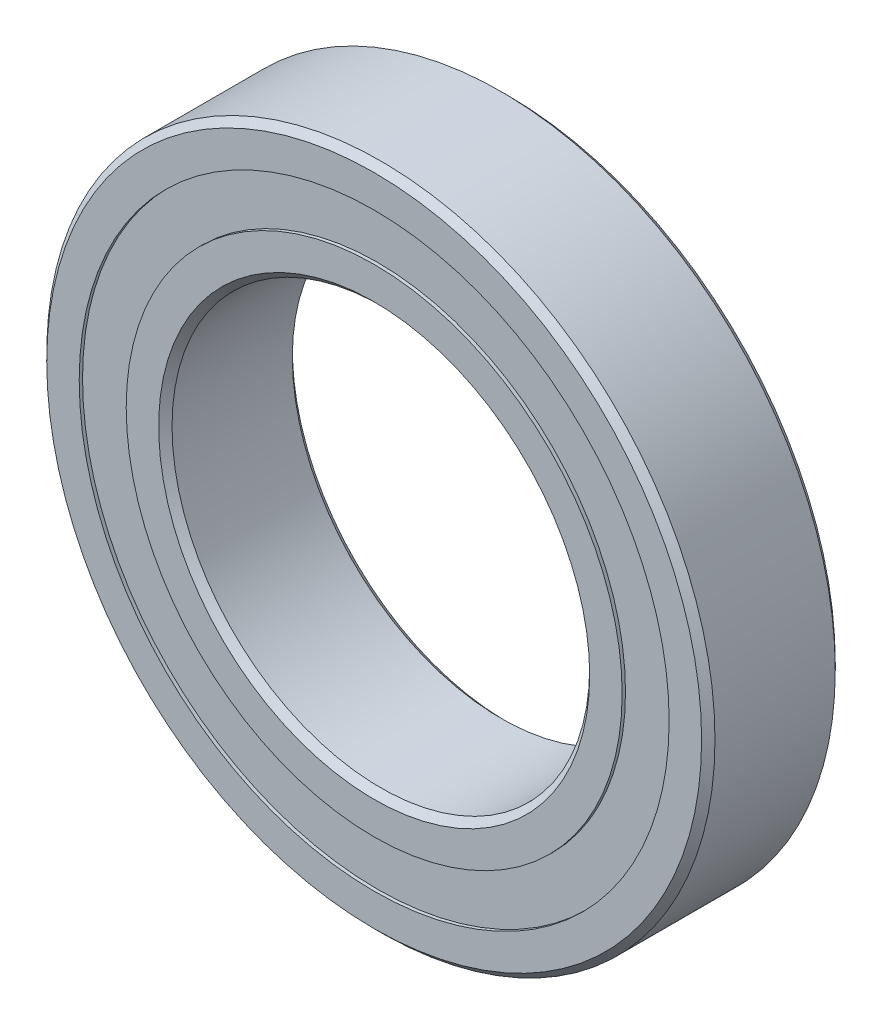
ISO-10303-21;
HEADER;
FILE_DESCRIPTION(('STEP AP214'),'2;1');
FILE_NAME('part.step','',(''),(''),'','','');
FILE_SCHEMA(('AUTOMOTIVE_DESIGN { 1 0 10303 214 1 1 1 1 }'));
ENDSEC;
DATA;
#1=APPLICATION_CONTEXT('core data for automotive mechanical design processes');
#2=APPLICATION_PROTOCOL_DEFINITION('international standard','automotive_design',2000,#1);
#3=PRODUCT_CONTEXT('',#1,'mechanical');
#4=PRODUCT('Part','Part','',(#3));
#5=PRODUCT_RELATED_PRODUCT_CATEGORY('part','',(#4));
#6=PRODUCT_DEFINITION_FORMATION('','',#4);
#7=PRODUCT_DEFINITION_CONTEXT('part definition',#1,'design');
#8=PRODUCT_DEFINITION('design','',#6,#7);
#9=PRODUCT_DEFINITION_SHAPE('','',#8);
#10=(LENGTH_UNIT() NAMED_UNIT(*) SI_UNIT(.MILLI.,.METRE.));
#11=(NAMED_UNIT(*) PLANE_ANGLE_UNIT() SI_UNIT($,.RADIAN.));
#12=(NAMED_UNIT(*) SI_UNIT($,.STERADIAN.) SOLID_ANGLE_UNIT());
#13=UNCERTAINTY_MEASURE_WITH_UNIT(LENGTH_MEASURE(1.E-05),#10,'distance_accuracy_value','');
#14=(GEOMETRIC_REPRESENTATION_CONTEXT(3) GLOBAL_UNCERTAINTY_ASSIGNED_CONTEXT((#13)) GLOBAL_UNIT_ASSIGNED_CONTEXT((#10,
#11,#12)) REPRESENTATION_CONTEXT('',''));
#15=CARTESIAN_POINT('',(0.,0.,0.));
#16=DIRECTION('',(0.,0.,1.));
#17=DIRECTION('',(1.,0.,0.));
#18=AXIS2_PLACEMENT_3D('',#15,#16,#17);
#19=CARTESIAN_POINT('',(0.,35.3131868131868,-7.60000000000001));
#20=DIRECTION('',(0.,0.,1.));
#21=DIRECTION('',(1.,0.,0.));
#22=AXIS2_PLACEMENT_3D('',#19,#20,#21);
#23=PLANE('',#22);
#24=CARTESIAN_POINT('',(0.,0.,-7.60000000000001));
#25=DIRECTION('',(0.,0.,1.));
#26=DIRECTION('',(1.,0.,0.));
#27=AXIS2_PLACEMENT_3D('',#24,#25,#26);
#28=CIRCLE('',#27,35.3131868131868);
#29=CARTESIAN_POINT('',(35.3131868131868,0.,-7.60000000000001));
#30=VERTEX_POINT('',#29);
#31=EDGE_CURVE('E55',#30,#30,#28,.T.);
#32=ORIENTED_EDGE('',*,*,#31,.F.);
#33=EDGE_LOOP('',(#32));
#34=FACE_BOUND('',#33,.T.);
#35=CARTESIAN_POINT('',(0.,0.,-7.60000000000001));
#36=DIRECTION('',(0.,0.,1.));
#37=DIRECTION('',(1.,0.,0.));
#38=AXIS2_PLACEMENT_3D('',#35,#36,#37);
#39=CIRCLE('',#38,29.6868131868132);
#40=CARTESIAN_POINT('',(29.6868131868132,0.,-7.60000000000001));
#41=VERTEX_POINT('',#40);
#42=EDGE_CURVE('E11',#41,#41,#39,.T.);
#43=ORIENTED_EDGE('',*,*,#42,.T.);
#44=EDGE_LOOP('',(#43));
#45=FACE_BOUND('',#44,.T.);
#46=ADVANCED_FACE('F41',(#34,#45),#23,.F.);
#47=CARTESIAN_POINT('',(0.,0.,8.));
#48=DIRECTION('',(0.,0.,1.));
#49=DIRECTION('',(1.,0.,0.));
#50=AXIS2_PLACEMENT_3D('',#47,#48,#49);
#51=CYLINDRICAL_SURFACE('',#50,29.6868131868132);
#52=ORIENTED_EDGE('',*,*,#42,.F.);
#53=EDGE_LOOP('',(#52));
#54=FACE_BOUND('',#53,.T.);
#55=CARTESIAN_POINT('',(0.,0.,-4.53387200464792));
#56=DIRECTION('',(0.,0.,1.));
#57=DIRECTION('',(1.,0.,0.));
#58=AXIS2_PLACEMENT_3D('',#55,#56,#57);
#59=CIRCLE('',#58,29.6868131868132);
#60=CARTESIAN_POINT('',(29.6868131868132,0.,-4.53387200464792));
#61=VERTEX_POINT('',#60);
#62=EDGE_CURVE('E47',#61,#61,#59,.T.);
#63=ORIENTED_EDGE('',*,*,#62,.T.);
#64=EDGE_LOOP('',(#63));
#65=FACE_BOUND('',#64,.T.);
#66=ADVANCED_FACE('F64',(#54,#65),#51,.F.);
#67=CARTESIAN_POINT('',(0.,35.3131868131868,-4.53387200464792));
#68=DIRECTION('',(0.,0.,-1.));
#69=DIRECTION('',(-1.,0.,0.));
#70=AXIS2_PLACEMENT_3D('',#67,#68,#69);
#71=PLANE('',#70);
#72=ORIENTED_EDGE('',*,*,#62,.F.);
#73=EDGE_LOOP('',(#72));
#74=FACE_BOUND('',#73,.T.);
#75=CARTESIAN_POINT('',(0.,0.,-4.53387200464792));
#76=DIRECTION('',(0.,0.,1.));
#77=DIRECTION('',(1.,0.,0.));
#78=AXIS2_PLACEMENT_3D('',#75,#76,#77);
#79=CIRCLE('',#78,35.3131868131868);
#80=CARTESIAN_POINT('',(35.3131868131868,0.,-4.53387200464792));
#81=VERTEX_POINT('',#80);
#82=EDGE_CURVE('E51',#81,#81,#79,.T.);
#83=ORIENTED_EDGE('',*,*,#82,.T.);
#84=EDGE_LOOP('',(#83));
#85=FACE_BOUND('',#84,.T.);
#86=ADVANCED_FACE('F68',(#74,#85),#71,.F.);
#87=CARTESIAN_POINT('',(0.,0.,8.));
#88=DIRECTION('',(0.,0.,1.));
#89=DIRECTION('',(1.,0.,0.));
#90=AXIS2_PLACEMENT_3D('',#87,#88,#89);
#91=CYLINDRICAL_SURFACE('',#90,35.3131868131868);
#92=ORIENTED_EDGE('',*,*,#82,.F.);
#93=EDGE_LOOP('',(#92));
#94=FACE_BOUND('',#93,.T.);
#95=ORIENTED_EDGE('',*,*,#31,.T.);
#96=EDGE_LOOP('',(#95));
#97=FACE_BOUND('',#96,.T.);
#98=ADVANCED_FACE('F61',(#94,#97),#91,.T.);
#99=CLOSED_SHELL('',(#46,#66,#86,#98));
#100=MANIFOLD_SOLID_BREP('B2',#99);
#101=CARTESIAN_POINT('',(0.,35.3131868131868,7.6));
#102=DIRECTION('',(0.,0.,-1.));
#103=DIRECTION('',(-1.,0.,0.));
#104=AXIS2_PLACEMENT_3D('',#101,#102,#103);
#105=PLANE('',#104);
#106=CARTESIAN_POINT('',(0.,0.,7.6));
#107=DIRECTION('',(0.,0.,1.));
#108=DIRECTION('',(1.,0.,0.));
#109=AXIS2_PLACEMENT_3D('',#106,#107,#108);
#110=CIRCLE('',#109,29.6868131868132);
#111=CARTESIAN_POINT('',(29.6868131868132,0.,7.6));
#112=VERTEX_POINT('',#111);
#113=EDGE_CURVE('E40',#112,#112,#110,.T.);
#114=ORIENTED_EDGE('',*,*,#113,.F.);
#115=EDGE_LOOP('',(#114));
#116=FACE_BOUND('',#115,.T.);
#117=CARTESIAN_POINT('',(0.,0.,7.6));
#118=DIRECTION('',(0.,0.,1.));
#119=DIRECTION('',(1.,0.,0.));
#120=AXIS2_PLACEMENT_3D('',#117,#118,#119);
#121=CIRCLE('',#120,35.3131868131868);
#122=CARTESIAN_POINT('',(35.3131868131868,0.,7.6));
#123=VERTEX_POINT('',#122);
#124=EDGE_CURVE('E122',#123,#123,#121,.T.);
#125=ORIENTED_EDGE('',*,*,#124,.T.);
#126=EDGE_LOOP('',(#125));
#127=FACE_BOUND('',#126,.T.);
#128=ADVANCED_FACE('F108',(#116,#127),#105,.F.);
#129=CARTESIAN_POINT('',(0.,0.,8.));
#130=DIRECTION('',(0.,0.,1.));
#131=DIRECTION('',(1.,0.,0.));
#132=AXIS2_PLACEMENT_3D('',#129,#130,#131);
#133=CYLINDRICAL_SURFACE('',#132,29.6868131868132);
#134=CARTESIAN_POINT('',(0.,0.,4.53387200464791));
#135=DIRECTION('',(0.,0.,1.));
#136=DIRECTION('',(1.,0.,0.));
#137=AXIS2_PLACEMENT_3D('',#134,#135,#136);
#138=CIRCLE('',#137,29.6868131868132);
#139=CARTESIAN_POINT('',(29.6868131868132,0.,4.53387200464791));
#140=VERTEX_POINT('',#139);
#141=EDGE_CURVE('E114',#140,#140,#138,.T.);
#142=ORIENTED_EDGE('',*,*,#141,.F.);
#143=EDGE_LOOP('',(#142));
#144=FACE_BOUND('',#143,.T.);
#145=ORIENTED_EDGE('',*,*,#113,.T.);
#146=EDGE_LOOP('',(#145));
#147=FACE_BOUND('',#146,.T.);
#148=ADVANCED_FACE('F137',(#144,#147),#133,.F.);
#149=CARTESIAN_POINT('',(0.,35.3131868131868,4.53387200464791));
#150=DIRECTION('',(0.,0.,1.));
#151=DIRECTION('',(1.,0.,0.));
#152=AXIS2_PLACEMENT_3D('',#149,#150,#151);
#153=PLANE('',#152);
#154=CARTESIAN_POINT('',(0.,0.,4.53387200464791));
#155=DIRECTION('',(0.,0.,1.));
#156=DIRECTION('',(1.,0.,0.));
#157=AXIS2_PLACEMENT_3D('',#154,#155,#156);
#158=CIRCLE('',#157,35.3131868131868);
#159=CARTESIAN_POINT('',(35.3131868131868,0.,4.53387200464791));
#160=VERTEX_POINT('',#159);
#161=EDGE_CURVE('E118',#160,#160,#158,.T.);
#162=ORIENTED_EDGE('',*,*,#161,.F.);
#163=EDGE_LOOP('',(#162));
#164=FACE_BOUND('',#163,.T.);
#165=ORIENTED_EDGE('',*,*,#141,.T.);
#166=EDGE_LOOP('',(#165));
#167=FACE_BOUND('',#166,.T.);
#168=ADVANCED_FACE('F132',(#164,#167),#153,.F.);
#169=CARTESIAN_POINT('',(0.,0.,8.));
#170=DIRECTION('',(0.,0.,1.));
#171=DIRECTION('',(1.,0.,0.));
#172=AXIS2_PLACEMENT_3D('',#169,#170,#171);
#173=CYLINDRICAL_SURFACE('',#172,35.3131868131868);
#174=ORIENTED_EDGE('',*,*,#124,.F.);
#175=EDGE_LOOP('',(#174));
#176=FACE_BOUND('',#175,.T.);
#177=ORIENTED_EDGE('',*,*,#161,.T.);
#178=EDGE_LOOP('',(#177));
#179=FACE_BOUND('',#178,.T.);
#180=ADVANCED_FACE('F129',(#176,#179),#173,.T.);
#181=CLOSED_SHELL('',(#128,#148,#168,#180));
#182=MANIFOLD_SOLID_BREP('B6',#181);
#183=CARTESIAN_POINT('',(-16.2499999999996,28.1458256229945,0.));
#184=DIRECTION('',(0.,0.,1.));
#185=DIRECTION('',(-0.499999999999989,0.866025403784445,0.));
#186=AXIS2_PLACEMENT_3D('',#183,#184,#185);
#187=SPHERICAL_SURFACE('',#186,4.53387200464792);
#188=CARTESIAN_POINT('',(-16.2499999999996,28.1458256229945,4.53387200464791));
#189=VERTEX_POINT('',#188);
#190=VERTEX_LOOP('',#189);
#191=FACE_BOUND('',#190,.T.);
#192=ADVANCED_FACE('F175',(#191),#187,.T.);
#193=CLOSED_SHELL('',(#192));
#194=MANIFOLD_SOLID_BREP('B35',#193);
#195=CARTESIAN_POINT('',(-28.1458256229941,16.2500000000003,0.));
#196=DIRECTION('',(0.,0.,1.));
#197=DIRECTION('',(-0.866025403784433,0.50000000000001,0.));
#198=AXIS2_PLACEMENT_3D('',#195,#196,#197);
#199=SPHERICAL_SURFACE('',#198,4.53387200464792);
#200=CARTESIAN_POINT('',(-28.1458256229941,16.2500000000003,4.53387200464791));
#201=VERTEX_POINT('',#200);
#202=VERTEX_LOOP('',#201);
#203=FACE_BOUND('',#202,.T.);
#204=ADVANCED_FACE('F195',(#203),#199,.T.);
#205=CLOSED_SHELL('',(#204));
#206=MANIFOLD_SOLID_BREP('B104',#205);
#207=CARTESIAN_POINT('',(-32.5,3.40419430537206E-13,0.));
#208=DIRECTION('',(0.,0.,1.));
#209=DIRECTION('',(-1.,0.,0.));
#210=AXIS2_PLACEMENT_3D('',#207,#208,#209);
#211=SPHERICAL_SURFACE('',#210,4.53387200464792);
#212=CARTESIAN_POINT('',(-32.5,3.40419430537206E-13,4.53387200464791));
#213=VERTEX_POINT('',#212);
#214=VERTEX_LOOP('',#213);
#215=FACE_BOUND('',#214,.T.);
#216=ADVANCED_FACE('F215',(#215),#211,.T.);
#217=CLOSED_SHELL('',(#216));
#218=MANIFOLD_SOLID_BREP('B171',#217);
#219=CARTESIAN_POINT('',(-28.1458256229944,-16.2499999999997,0.));
#220=DIRECTION('',(0.,0.,1.));
#221=DIRECTION('',(-0.866025403784443,-0.499999999999992,0.));
#222=AXIS2_PLACEMENT_3D('',#219,#220,#221);
#223=SPHERICAL_SURFACE('',#222,4.53387200464792);
#224=CARTESIAN_POINT('',(-28.1458256229944,-16.2499999999997,4.53387200464791));
#225=VERTEX_POINT('',#224);
#226=VERTEX_LOOP('',#225);
#227=FACE_BOUND('',#226,.T.);
#228=ADVANCED_FACE('F235',(#227),#223,.T.);
#229=CLOSED_SHELL('',(#228));
#230=MANIFOLD_SOLID_BREP('B191',#229);
#231=CARTESIAN_POINT('',(-16.2500000000002,-28.1458256229941,0.));
#232=DIRECTION('',(0.,0.,1.));
#233=DIRECTION('',(-0.500000000000007,-0.866025403784435,0.));
#234=AXIS2_PLACEMENT_3D('',#231,#232,#233);
#235=SPHERICAL_SURFACE('',#234,4.53387200464792);
#236=CARTESIAN_POINT('',(-16.2500000000002,-28.1458256229941,4.53387200464791));
#237=VERTEX_POINT('',#236);
#238=VERTEX_LOOP('',#237);
#239=FACE_BOUND('',#238,.T.);
#240=ADVANCED_FACE('F255',(#239),#235,.T.);
#241=CLOSED_SHELL('',(#240));
#242=MANIFOLD_SOLID_BREP('B211',#241);
#243=CARTESIAN_POINT('',(-2.26946287024804E-13,-32.5,0.));
#244=DIRECTION('',(0.,0.,1.));
#245=DIRECTION('',(0.,-1.,0.));
#246=AXIS2_PLACEMENT_3D('',#243,#244,#245);
#247=SPHERICAL_SURFACE('',#246,4.53387200464792);
#248=CARTESIAN_POINT('',(-2.26946287024804E-13,-32.5,4.53387200464791));
#249=VERTEX_POINT('',#248);
#250=VERTEX_LOOP('',#249);
#251=FACE_BOUND('',#250,.T.);
#252=ADVANCED_FACE('F275',(#251),#247,.T.);
#253=CLOSED_SHELL('',(#252));
#254=MANIFOLD_SOLID_BREP('B231',#253);
#255=CARTESIAN_POINT('',(16.2499999999998,-28.1458256229944,0.));
#256=DIRECTION('',(0.,0.,1.));
#257=DIRECTION('',(0.499999999999995,-0.866025403784442,0.));
#258=AXIS2_PLACEMENT_3D('',#255,#256,#257);
#259=SPHERICAL_SURFACE('',#258,4.53387200464792);
#260=CARTESIAN_POINT('',(16.2499999999998,-28.1458256229944,4.53387200464791));
#261=VERTEX_POINT('',#260);
#262=VERTEX_LOOP('',#261);
#263=FACE_BOUND('',#262,.T.);
#264=ADVANCED_FACE('F295',(#263),#259,.T.);
#265=CLOSED_SHELL('',(#264));
#266=MANIFOLD_SOLID_BREP('B251',#265);
#267=CARTESIAN_POINT('',(28.1458256229942,-16.2500000000001,0.));
#268=DIRECTION('',(0.,0.,1.));
#269=DIRECTION('',(0.866025403784436,-0.500000000000004,0.));
#270=AXIS2_PLACEMENT_3D('',#267,#268,#269);
#271=SPHERICAL_SURFACE('',#270,4.53387200464792);
#272=CARTESIAN_POINT('',(28.1458256229942,-16.2500000000001,4.53387200464791));
#273=VERTEX_POINT('',#272);
#274=VERTEX_LOOP('',#273);
#275=FACE_BOUND('',#274,.T.);
#276=ADVANCED_FACE('F315',(#275),#271,.T.);
#277=CLOSED_SHELL('',(#276));
#278=MANIFOLD_SOLID_BREP('B271',#277);
#279=CARTESIAN_POINT('',(32.5,-1.13473143512402E-13,0.));
#280=DIRECTION('',(0.,0.,1.));
#281=DIRECTION('',(1.,0.,0.));
#282=AXIS2_PLACEMENT_3D('',#279,#280,#281);
#283=SPHERICAL_SURFACE('',#282,4.53387200464792);
#284=CARTESIAN_POINT('',(32.5,-1.13473143512402E-13,4.53387200464791));
#285=VERTEX_POINT('',#284);
#286=VERTEX_LOOP('',#285);
#287=FACE_BOUND('',#286,.T.);
#288=ADVANCED_FACE('F335',(#287),#283,.T.);
#289=CLOSED_SHELL('',(#288));
#290=MANIFOLD_SOLID_BREP('B291',#289);
#291=CARTESIAN_POINT('',(28.1458256229943,16.2499999999999,0.));
#292=DIRECTION('',(0.,0.,1.));
#293=DIRECTION('',(0.86602540378444,0.499999999999998,0.));
#294=AXIS2_PLACEMENT_3D('',#291,#292,#293);
#295=SPHERICAL_SURFACE('',#294,4.53387200464792);
#296=CARTESIAN_POINT('',(28.1458256229943,16.2499999999999,4.53387200464791));
#297=VERTEX_POINT('',#296);
#298=VERTEX_LOOP('',#297);
#299=FACE_BOUND('',#298,.T.);
#300=ADVANCED_FACE('F355',(#299),#295,.T.);
#301=CLOSED_SHELL('',(#300));
#302=MANIFOLD_SOLID_BREP('B311',#301);
#303=CARTESIAN_POINT('',(16.25,28.1458256229942,0.));
#304=DIRECTION('',(0.,0.,1.));
#305=DIRECTION('',(0.500000000000001,0.866025403784438,0.));
#306=AXIS2_PLACEMENT_3D('',#303,#304,#305);
#307=SPHERICAL_SURFACE('',#306,4.53387200464792);
#308=CARTESIAN_POINT('',(16.25,28.1458256229942,4.53387200464791));
#309=VERTEX_POINT('',#308);
#310=VERTEX_LOOP('',#309);
#311=FACE_BOUND('',#310,.T.);
#312=ADVANCED_FACE('F375',(#311),#307,.T.);
#313=CLOSED_SHELL('',(#312));
#314=MANIFOLD_SOLID_BREP('B331',#313);
#315=CARTESIAN_POINT('',(0.,32.5,0.));
#316=DIRECTION('',(0.,0.,1.));
#317=DIRECTION('',(0.,1.,0.));
#318=AXIS2_PLACEMENT_3D('',#315,#316,#317);
#319=SPHERICAL_SURFACE('',#318,4.53387200464792);
#320=CARTESIAN_POINT('',(0.,32.5,4.53387200464791));
#321=VERTEX_POINT('',#320);
#322=VERTEX_LOOP('',#321);
#323=FACE_BOUND('',#322,.T.);
#324=ADVANCED_FACE('F397',(#323),#319,.T.);
#325=CLOSED_SHELL('',(#324));
#326=MANIFOLD_SOLID_BREP('B351',#325);
#327=CARTESIAN_POINT('',(0.,29.6868131868132,8.));
#328=DIRECTION('',(0.,0.,-1.));
#329=DIRECTION('',(-1.,0.,0.));
#330=AXIS2_PLACEMENT_3D('',#327,#328,#329);
#331=PLANE('',#330);
#332=CARTESIAN_POINT('',(0.,0.,8.));
#333=DIRECTION('',(0.,0.,1.));
#334=DIRECTION('',(1.,0.,0.));
#335=AXIS2_PLACEMENT_3D('',#332,#333,#334);
#336=CIRCLE('',#335,25.8);
#337=CARTESIAN_POINT('',(25.8,0.,8.));
#338=VERTEX_POINT('',#337);
#339=EDGE_CURVE('E444',#338,#338,#336,.T.);
#340=ORIENTED_EDGE('',*,*,#339,.F.);
#341=EDGE_LOOP('',(#340));
#342=FACE_BOUND('',#341,.T.);
#343=CARTESIAN_POINT('',(0.,0.,8.));
#344=DIRECTION('',(0.,0.,1.));
#345=DIRECTION('',(1.,0.,0.));
#346=AXIS2_PLACEMENT_3D('',#343,#344,#345);
#347=CIRCLE('',#346,29.6868131868132);
#348=CARTESIAN_POINT('',(29.6868131868132,0.,8.));
#349=VERTEX_POINT('',#348);
#350=EDGE_CURVE('E396',#349,#349,#347,.T.);
#351=ORIENTED_EDGE('',*,*,#350,.T.);
#352=EDGE_LOOP('',(#351));
#353=FACE_BOUND('',#352,.T.);
#354=ADVANCED_FACE('F416',(#342,#353),#331,.F.);
#355=CARTESIAN_POINT('',(0.,0.,8.));
#356=DIRECTION('',(0.,0.,1.));
#357=DIRECTION('',(1.,0.,0.));
#358=AXIS2_PLACEMENT_3D('',#355,#356,#357);
#359=CYLINDRICAL_SURFACE('',#358,29.6868131868132);
#360=ORIENTED_EDGE('',*,*,#350,.F.);
#361=EDGE_LOOP('',(#360));
#362=FACE_BOUND('',#361,.T.);
#363=CARTESIAN_POINT('',(0.,0.,3.55555555555555));
#364=DIRECTION('',(0.,0.,1.));
#365=DIRECTION('',(1.,0.,0.));
#366=AXIS2_PLACEMENT_3D('',#363,#364,#365);
#367=CIRCLE('',#366,29.6868131868132);
#368=CARTESIAN_POINT('',(29.6868131868132,0.,3.55555555555555));
#369=VERTEX_POINT('',#368);
#370=EDGE_CURVE('E422',#369,#369,#367,.T.);
#371=ORIENTED_EDGE('',*,*,#370,.T.);
#372=EDGE_LOOP('',(#371));
#373=FACE_BOUND('',#372,.T.);
#374=ADVANCED_FACE('F451',(#362,#373),#359,.T.);
#375=CARTESIAN_POINT('',(0.,0.,0.));
#376=DIRECTION('',(0.,0.,1.));
#377=DIRECTION('',(1.,0.,0.));
#378=AXIS2_PLACEMENT_3D('',#375,#376,#377);
#379=TOROIDAL_SURFACE('',#378,32.5,4.5338720046479);
#380=ORIENTED_EDGE('',*,*,#370,.F.);
#381=EDGE_LOOP('',(#380));
#382=FACE_BOUND('',#381,.T.);
#383=CARTESIAN_POINT('',(0.,0.,-3.55555555555556));
#384=DIRECTION('',(0.,0.,1.));
#385=DIRECTION('',(1.,0.,0.));
#386=AXIS2_PLACEMENT_3D('',#383,#384,#385);
#387=CIRCLE('',#386,29.6868131868132);
#388=CARTESIAN_POINT('',(29.6868131868132,0.,-3.55555555555556));
#389=VERTEX_POINT('',#388);
#390=EDGE_CURVE('E426',#389,#389,#387,.T.);
#391=ORIENTED_EDGE('',*,*,#390,.T.);
#392=EDGE_LOOP('',(#391));
#393=FACE_BOUND('',#392,.T.);
#394=ADVANCED_FACE('F455',(#382,#393),#379,.F.);
#395=CARTESIAN_POINT('',(0.,0.,8.));
#396=DIRECTION('',(0.,0.,1.));
#397=DIRECTION('',(1.,0.,0.));
#398=AXIS2_PLACEMENT_3D('',#395,#396,#397);
#399=CYLINDRICAL_SURFACE('',#398,29.6868131868132);
#400=ORIENTED_EDGE('',*,*,#390,.F.);
#401=EDGE_LOOP('',(#400));
#402=FACE_BOUND('',#401,.T.);
#403=CARTESIAN_POINT('',(0.,0.,-8.));
#404=DIRECTION('',(0.,0.,1.));
#405=DIRECTION('',(1.,0.,0.));
#406=AXIS2_PLACEMENT_3D('',#403,#404,#405);
#407=CIRCLE('',#406,29.6868131868132);
#408=CARTESIAN_POINT('',(29.6868131868132,0.,-8.));
#409=VERTEX_POINT('',#408);
#410=EDGE_CURVE('E430',#409,#409,#407,.T.);
#411=ORIENTED_EDGE('',*,*,#410,.T.);
#412=EDGE_LOOP('',(#411));
#413=FACE_BOUND('',#412,.T.);
#414=ADVANCED_FACE('F460',(#402,#413),#399,.T.);
#415=CARTESIAN_POINT('',(0.,25.8,-8.));
#416=DIRECTION('',(0.,0.,1.));
#417=DIRECTION('',(1.,0.,0.));
#418=AXIS2_PLACEMENT_3D('',#415,#416,#417);
#419=PLANE('',#418);
#420=ORIENTED_EDGE('',*,*,#410,.F.);
#421=EDGE_LOOP('',(#420));
#422=FACE_BOUND('',#421,.T.);
#423=CARTESIAN_POINT('',(0.,0.,-8.));
#424=DIRECTION('',(0.,0.,1.));
#425=DIRECTION('',(1.,0.,0.));
#426=AXIS2_PLACEMENT_3D('',#423,#424,#425);
#427=CIRCLE('',#426,25.8);
#428=CARTESIAN_POINT('',(25.8,0.,-8.));
#429=VERTEX_POINT('',#428);
#430=EDGE_CURVE('E435',#429,#429,#427,.T.);
#431=ORIENTED_EDGE('',*,*,#430,.T.);
#432=EDGE_LOOP('',(#431));
#433=FACE_BOUND('',#432,.T.);
#434=ADVANCED_FACE('F466',(#422,#433),#419,.F.);
#435=CARTESIAN_POINT('',(0.,0.,-7.2));
#436=DIRECTION('',(0.,0.,-1.));
#437=DIRECTION('',(-1.,0.,0.));
#438=AXIS2_PLACEMENT_3D('',#435,#436,#437);
#439=CONICAL_SURFACE('',#438,25.,0.785398163397446);
#440=ORIENTED_EDGE('',*,*,#430,.F.);
#441=EDGE_LOOP('',(#440));
#442=FACE_BOUND('',#441,.T.);
#443=CARTESIAN_POINT('',(0.,0.,-7.2));
#444=DIRECTION('',(0.,0.,1.));
#445=DIRECTION('',(1.,0.,0.));
#446=AXIS2_PLACEMENT_3D('',#443,#444,#445);
#447=CIRCLE('',#446,25.);
#448=CARTESIAN_POINT('',(25.,0.,-7.2));
#449=VERTEX_POINT('',#448);
#450=EDGE_CURVE('E438',#449,#449,#447,.T.);
#451=ORIENTED_EDGE('',*,*,#450,.T.);
#452=EDGE_LOOP('',(#451));
#453=FACE_BOUND('',#452,.T.);
#454=ADVANCED_FACE('F470',(#442,#453),#439,.F.);
#455=CARTESIAN_POINT('',(0.,0.,8.));
#456=DIRECTION('',(0.,0.,1.));
#457=DIRECTION('',(1.,0.,0.));
#458=AXIS2_PLACEMENT_3D('',#455,#456,#457);
#459=CYLINDRICAL_SURFACE('',#458,25.);
#460=ORIENTED_EDGE('',*,*,#450,.F.);
#461=EDGE_LOOP('',(#460));
#462=FACE_BOUND('',#461,.T.);
#463=CARTESIAN_POINT('',(0.,0.,7.20000000000001));
#464=DIRECTION('',(0.,0.,1.));
#465=DIRECTION('',(1.,0.,0.));
#466=AXIS2_PLACEMENT_3D('',#463,#464,#465);
#467=CIRCLE('',#466,25.);
#468=CARTESIAN_POINT('',(25.,0.,7.20000000000001));
#469=VERTEX_POINT('',#468);
#470=EDGE_CURVE('E441',#469,#469,#467,.T.);
#471=ORIENTED_EDGE('',*,*,#470,.T.);
#472=EDGE_LOOP('',(#471));
#473=FACE_BOUND('',#472,.T.);
#474=ADVANCED_FACE('F474',(#462,#473),#459,.F.);
#475=CARTESIAN_POINT('',(0.,0.,8.));
#476=DIRECTION('',(0.,0.,1.));
#477=DIRECTION('',(1.,0.,0.));
#478=AXIS2_PLACEMENT_3D('',#475,#476,#477);
#479=CONICAL_SURFACE('',#478,25.8,0.785398163397449);
#480=ORIENTED_EDGE('',*,*,#470,.F.);
#481=EDGE_LOOP('',(#480));
#482=FACE_BOUND('',#481,.T.);
#483=ORIENTED_EDGE('',*,*,#339,.T.);
#484=EDGE_LOOP('',(#483));
#485=FACE_BOUND('',#484,.T.);
#486=ADVANCED_FACE('F448',(#482,#485),#479,.F.);
#487=CLOSED_SHELL('',(#354,#374,#394,#414,#434,#454,#474,#486));
#488=MANIFOLD_SOLID_BREP('B371',#487);
#489=CARTESIAN_POINT('',(0.,0.,7.2));
#490=DIRECTION('',(0.,0.,-1.));
#491=DIRECTION('',(-1.,0.,0.));
#492=AXIS2_PLACEMENT_3D('',#489,#490,#491);
#493=CONICAL_SURFACE('',#492,40.,0.785398163397446);
#494=CARTESIAN_POINT('',(0.,0.,8.));
#495=DIRECTION('',(0.,0.,1.));
#496=DIRECTION('',(1.,0.,0.));
#497=AXIS2_PLACEMENT_3D('',#494,#495,#496);
#498=CIRCLE('',#497,39.2);
#499=CARTESIAN_POINT('',(39.2,0.,8.));
#500=VERTEX_POINT('',#499);
#501=EDGE_CURVE('E565',#500,#500,#498,.T.);
#502=ORIENTED_EDGE('',*,*,#501,.F.);
#503=EDGE_LOOP('',(#502));
#504=FACE_BOUND('',#503,.T.);
#505=CARTESIAN_POINT('',(0.,0.,7.2));
#506=DIRECTION('',(0.,0.,1.));
#507=DIRECTION('',(1.,0.,0.));
#508=AXIS2_PLACEMENT_3D('',#505,#506,#507);
#509=CIRCLE('',#508,40.);
#510=CARTESIAN_POINT('',(40.,0.,7.2));
#511=VERTEX_POINT('',#510);
#512=EDGE_CURVE('E415',#511,#511,#509,.T.);
#513=ORIENTED_EDGE('',*,*,#512,.T.);
#514=EDGE_LOOP('',(#513));
#515=FACE_BOUND('',#514,.T.);
#516=ADVANCED_FACE('F537',(#504,#515),#493,.T.);
#517=CARTESIAN_POINT('',(0.,0.,8.));
#518=DIRECTION('',(0.,0.,1.));
#519=DIRECTION('',(1.,0.,0.));
#520=AXIS2_PLACEMENT_3D('',#517,#518,#519);
#521=CYLINDRICAL_SURFACE('',#520,40.);
#522=ORIENTED_EDGE('',*,*,#512,.F.);
#523=EDGE_LOOP('',(#522));
#524=FACE_BOUND('',#523,.T.);
#525=CARTESIAN_POINT('',(0.,0.,-7.2));
#526=DIRECTION('',(0.,0.,1.));
#527=DIRECTION('',(1.,0.,0.));
#528=AXIS2_PLACEMENT_3D('',#525,#526,#527);
#529=CIRCLE('',#528,40.);
#530=CARTESIAN_POINT('',(40.,0.,-7.2));
#531=VERTEX_POINT('',#530);
#532=EDGE_CURVE('E543',#531,#531,#529,.T.);
#533=ORIENTED_EDGE('',*,*,#532,.T.);
#534=EDGE_LOOP('',(#533));
#535=FACE_BOUND('',#534,.T.);
#536=ADVANCED_FACE('F572',(#524,#535),#521,.T.);
#537=CARTESIAN_POINT('',(0.,0.,-8.));
#538=DIRECTION('',(0.,0.,1.));
#539=DIRECTION('',(1.,0.,0.));
#540=AXIS2_PLACEMENT_3D('',#537,#538,#539);
#541=CONICAL_SURFACE('',#540,39.2,0.785398163397446);
#542=ORIENTED_EDGE('',*,*,#532,.F.);
#543=EDGE_LOOP('',(#542));
#544=FACE_BOUND('',#543,.T.);
#545=CARTESIAN_POINT('',(0.,0.,-8.));
#546=DIRECTION('',(0.,0.,1.));
#547=DIRECTION('',(1.,0.,0.));
#548=AXIS2_PLACEMENT_3D('',#545,#546,#547);
#549=CIRCLE('',#548,39.2);
#550=CARTESIAN_POINT('',(39.2,0.,-8.));
#551=VERTEX_POINT('',#550);
#552=EDGE_CURVE('E547',#551,#551,#549,.T.);
#553=ORIENTED_EDGE('',*,*,#552,.T.);
#554=EDGE_LOOP('',(#553));
#555=FACE_BOUND('',#554,.T.);
#556=ADVANCED_FACE('F576',(#544,#555),#541,.T.);
#557=CARTESIAN_POINT('',(0.,39.2,-8.));
#558=DIRECTION('',(0.,0.,1.));
#559=DIRECTION('',(1.,0.,0.));
#560=AXIS2_PLACEMENT_3D('',#557,#558,#559);
#561=PLANE('',#560);
#562=ORIENTED_EDGE('',*,*,#552,.F.);
#563=EDGE_LOOP('',(#562));
#564=FACE_BOUND('',#563,.T.);
#565=CARTESIAN_POINT('',(0.,0.,-8.00000000000001));
#566=DIRECTION('',(0.,0.,1.));
#567=DIRECTION('',(1.,0.,0.));
#568=AXIS2_PLACEMENT_3D('',#565,#566,#567);
#569=CIRCLE('',#568,35.3131868131868);
#570=CARTESIAN_POINT('',(35.3131868131868,0.,-8.00000000000001));
#571=VERTEX_POINT('',#570);
#572=EDGE_CURVE('E551',#571,#571,#569,.T.);
#573=ORIENTED_EDGE('',*,*,#572,.T.);
#574=EDGE_LOOP('',(#573));
#575=FACE_BOUND('',#574,.T.);
#576=ADVANCED_FACE('F581',(#564,#575),#561,.F.);
#577=CARTESIAN_POINT('',(0.,0.,8.));
#578=DIRECTION('',(0.,0.,1.));
#579=DIRECTION('',(1.,0.,0.));
#580=AXIS2_PLACEMENT_3D('',#577,#578,#579);
#581=CYLINDRICAL_SURFACE('',#580,35.3131868131868);
#582=ORIENTED_EDGE('',*,*,#572,.F.);
#583=EDGE_LOOP('',(#582));
#584=FACE_BOUND('',#583,.T.);
#585=CARTESIAN_POINT('',(0.,0.,-3.55555555555555));
#586=DIRECTION('',(0.,0.,1.));
#587=DIRECTION('',(1.,0.,0.));
#588=AXIS2_PLACEMENT_3D('',#585,#586,#587);
#589=CIRCLE('',#588,35.3131868131868);
#590=CARTESIAN_POINT('',(35.3131868131868,0.,-3.55555555555555));
#591=VERTEX_POINT('',#590);
#592=EDGE_CURVE('E556',#591,#591,#589,.T.);
#593=ORIENTED_EDGE('',*,*,#592,.T.);
#594=EDGE_LOOP('',(#593));
#595=FACE_BOUND('',#594,.T.);
#596=ADVANCED_FACE('F587',(#584,#595),#581,.F.);
#597=CARTESIAN_POINT('',(0.,0.,0.));
#598=DIRECTION('',(0.,0.,1.));
#599=DIRECTION('',(1.,0.,0.));
#600=AXIS2_PLACEMENT_3D('',#597,#598,#599);
#601=TOROIDAL_SURFACE('',#600,32.5,4.53387200464792);
#602=ORIENTED_EDGE('',*,*,#592,.F.);
#603=EDGE_LOOP('',(#602));
#604=FACE_BOUND('',#603,.T.);
#605=CARTESIAN_POINT('',(0.,0.,3.55555555555555));
#606=DIRECTION('',(0.,0.,1.));
#607=DIRECTION('',(1.,0.,0.));
#608=AXIS2_PLACEMENT_3D('',#605,#606,#607);
#609=CIRCLE('',#608,35.3131868131868);
#610=CARTESIAN_POINT('',(35.3131868131868,0.,3.55555555555555));
#611=VERTEX_POINT('',#610);
#612=EDGE_CURVE('E559',#611,#611,#609,.T.);
#613=ORIENTED_EDGE('',*,*,#612,.T.);
#614=EDGE_LOOP('',(#613));
#615=FACE_BOUND('',#614,.T.);
#616=ADVANCED_FACE('F591',(#604,#615),#601,.F.);
#617=CARTESIAN_POINT('',(0.,0.,8.));
#618=DIRECTION('',(0.,0.,1.));
#619=DIRECTION('',(1.,0.,0.));
#620=AXIS2_PLACEMENT_3D('',#617,#618,#619);
#621=CYLINDRICAL_SURFACE('',#620,35.3131868131868);
#622=ORIENTED_EDGE('',*,*,#612,.F.);
#623=EDGE_LOOP('',(#622));
#624=FACE_BOUND('',#623,.T.);
#625=CARTESIAN_POINT('',(0.,0.,8.00000000000001));
#626=DIRECTION('',(0.,0.,1.));
#627=DIRECTION('',(1.,0.,0.));
#628=AXIS2_PLACEMENT_3D('',#625,#626,#627);
#629=CIRCLE('',#628,35.3131868131868);
#630=CARTESIAN_POINT('',(35.3131868131868,0.,8.00000000000001));
#631=VERTEX_POINT('',#630);
#632=EDGE_CURVE('E562',#631,#631,#629,.T.);
#633=ORIENTED_EDGE('',*,*,#632,.T.);
#634=EDGE_LOOP('',(#633));
#635=FACE_BOUND('',#634,.T.);
#636=ADVANCED_FACE('F595',(#624,#635),#621,.F.);
#637=CARTESIAN_POINT('',(0.,39.2,8.));
#638=DIRECTION('',(0.,0.,-1.));
#639=DIRECTION('',(-1.,0.,0.));
#640=AXIS2_PLACEMENT_3D('',#637,#638,#639);
#641=PLANE('',#640);
#642=ORIENTED_EDGE('',*,*,#632,.F.);
#643=EDGE_LOOP('',(#642));
#644=FACE_BOUND('',#643,.T.);
#645=ORIENTED_EDGE('',*,*,#501,.T.);
#646=EDGE_LOOP('',(#645));
#647=FACE_BOUND('',#646,.T.);
#648=ADVANCED_FACE('F569',(#644,#647),#641,.F.);
#649=CLOSED_SHELL('',(#516,#536,#556,#576,#596,#616,#636,#648));
#650=MANIFOLD_SOLID_BREP('B391',#649);
#651=ADVANCED_BREP_SHAPE_REPRESENTATION('',(#18,#100,#182,#194,#206,#218,#230,#242,#254,#266,
#278,#290,#302,#314,#326,#488,#650),#14);
#652=SHAPE_DEFINITION_REPRESENTATION(#9,#651);
ENDSEC;
END-ISO-10303-21;
